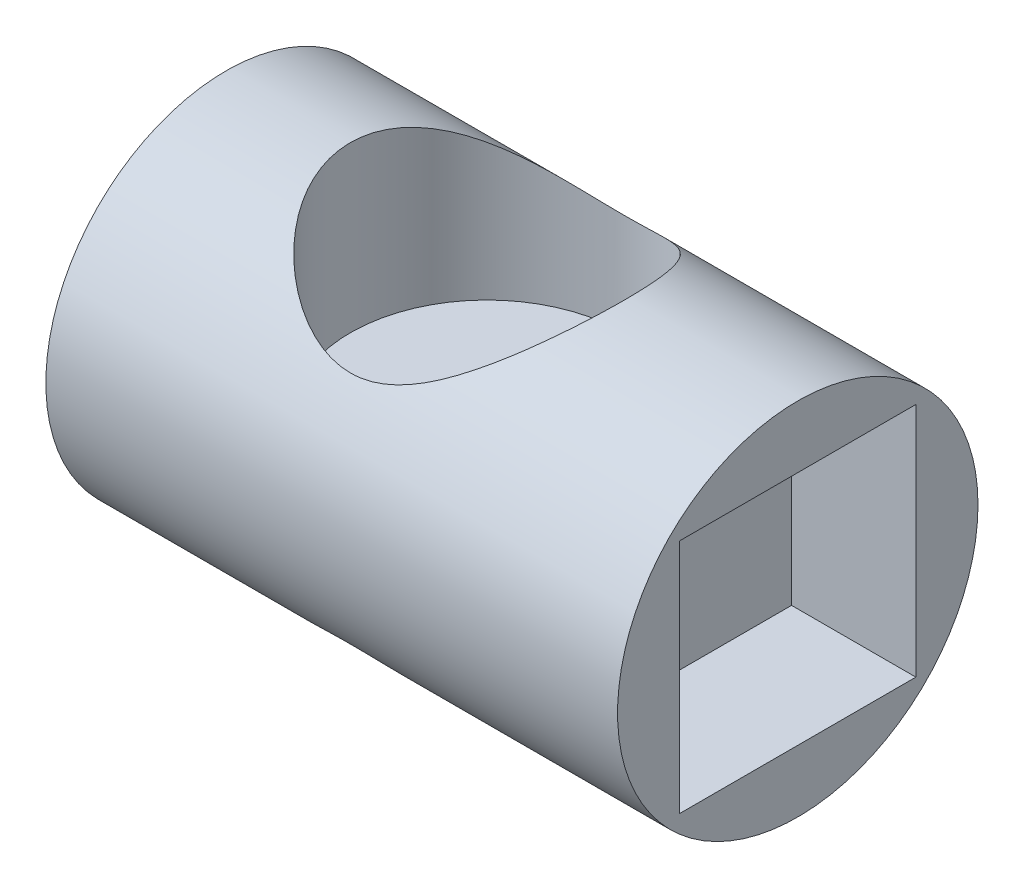
ISO-10303-21;
HEADER;
FILE_DESCRIPTION(('STEP AP214'),'2;1');
FILE_NAME('part.step','',(''),(''),'','','');
FILE_SCHEMA(('AUTOMOTIVE_DESIGN { 1 0 10303 214 1 1 1 1 }'));
ENDSEC;
DATA;
#1=APPLICATION_CONTEXT('core data for automotive mechanical design processes');
#2=APPLICATION_PROTOCOL_DEFINITION('international standard','automotive_design',2000,#1);
#3=PRODUCT_CONTEXT('',#1,'mechanical');
#4=PRODUCT('Part','Part','',(#3));
#5=PRODUCT_RELATED_PRODUCT_CATEGORY('part','',(#4));
#6=PRODUCT_DEFINITION_FORMATION('','',#4);
#7=PRODUCT_DEFINITION_CONTEXT('part definition',#1,'design');
#8=PRODUCT_DEFINITION('design','',#6,#7);
#9=PRODUCT_DEFINITION_SHAPE('','',#8);
#10=(LENGTH_UNIT() NAMED_UNIT(*) SI_UNIT(.MILLI.,.METRE.));
#11=(NAMED_UNIT(*) PLANE_ANGLE_UNIT() SI_UNIT($,.RADIAN.));
#12=(NAMED_UNIT(*) SI_UNIT($,.STERADIAN.) SOLID_ANGLE_UNIT());
#13=UNCERTAINTY_MEASURE_WITH_UNIT(LENGTH_MEASURE(1.E-05),#10,'distance_accuracy_value','');
#14=(GEOMETRIC_REPRESENTATION_CONTEXT(3) GLOBAL_UNCERTAINTY_ASSIGNED_CONTEXT((#13)) GLOBAL_UNIT_ASSIGNED_CONTEXT((#10,
#11,#12)) REPRESENTATION_CONTEXT('',''));
#15=CARTESIAN_POINT('',(0.,0.,0.));
#16=DIRECTION('',(0.,0.,1.));
#17=DIRECTION('',(1.,0.,0.));
#18=AXIS2_PLACEMENT_3D('',#15,#16,#17);
#19=CARTESIAN_POINT('',(21.,-14.5,0.));
#20=DIRECTION('',(0.,1.,0.));
#21=DIRECTION('',(0.,0.,1.));
#22=AXIS2_PLACEMENT_3D('',#19,#20,#21);
#23=CYLINDRICAL_SURFACE('',#22,11.);
#24=CARTESIAN_POINT('',(21.,9.4472218138456,11.));
#25=CARTESIAN_POINT('',(20.7446005731994,9.44721013003408,11.0000053962607));
#26=CARTESIAN_POINT('',(20.4892475808609,9.45763074036552,10.9910847628613));
#27=CARTESIAN_POINT('',(19.9812966515893,9.49861453554439,10.9556864130435));
#28=CARTESIAN_POINT('',(19.7286999122017,9.52918614709357,10.9292013515423));
#29=CARTESIAN_POINT('',(19.2281162230338,9.60875959209538,10.8593055433644));
#30=CARTESIAN_POINT('',(18.980144536923,9.65781392671205,10.8158465683821));
#31=CARTESIAN_POINT('',(18.4912154456175,9.77176611045917,10.713004298025));
#32=CARTESIAN_POINT('',(18.2502608810947,9.83667027881275,10.6536146502652));
#33=CARTESIAN_POINT('',(17.7278508311446,9.99413843126568,10.5062393116843));
#34=CARTESIAN_POINT('',(17.4482376542905,10.0896454125048,10.4148859145522));
#35=CARTESIAN_POINT('',(16.9017309924322,10.2947353646413,10.2122084113692));
#36=CARTESIAN_POINT('',(16.634841312876,10.4043225109854,10.1008783773846));
#37=CARTESIAN_POINT('',(16.1138628099463,10.633416801049,9.85942033437389));
#38=CARTESIAN_POINT('',(15.8597860185945,10.752932999861,9.72927508440315));
#39=CARTESIAN_POINT('',(15.3647821219516,10.9981573583915,9.4511855004057));
#40=CARTESIAN_POINT('',(15.1238538623957,11.1238649727376,9.30324273242778));
#41=CARTESIAN_POINT('',(14.6496884405595,11.3813843435625,8.98647503272673));
#42=CARTESIAN_POINT('',(14.4167650943934,11.513270125585,8.81724105492348));
#43=CARTESIAN_POINT('',(13.9650003772183,11.777421398586,8.46117578026142));
#44=CARTESIAN_POINT('',(13.7461594601614,11.9096869016616,8.27434391660652));
#45=CARTESIAN_POINT('',(13.323243272907,12.1718980708835,7.88354162957728));
#46=CARTESIAN_POINT('',(13.1191562286228,12.3018455231071,7.67958515957763));
#47=CARTESIAN_POINT('',(12.7263445491918,12.5571135283023,7.25467594975962));
#48=CARTESIAN_POINT('',(12.5376191921205,12.6824342985539,7.0337240095958));
#49=CARTESIAN_POINT('',(12.1841487686781,12.9210277801072,6.58475047418892));
#50=CARTESIAN_POINT('',(12.0187309549608,13.0345851577173,6.35741081944071));
#51=CARTESIAN_POINT('',(11.7041789357794,13.2532832012861,5.88791388609163));
#52=CARTESIAN_POINT('',(11.5550423286284,13.3584251080226,5.64575880120278));
#53=CARTESIAN_POINT('',(11.2744005833059,13.5583031305105,5.14728251864729));
#54=CARTESIAN_POINT('',(11.1428964591558,13.6530386477472,4.890960507455));
#55=CARTESIAN_POINT('',(10.899061672083,13.8301095568366,4.36520310201093));
#56=CARTESIAN_POINT('',(10.7867308571487,13.9124450469996,4.09576781174676));
#57=CARTESIAN_POINT('',(10.5818864605032,14.0635080367425,3.54269117523006));
#58=CARTESIAN_POINT('',(10.489566637256,14.1321020386283,3.25894112415066));
#59=CARTESIAN_POINT('',(10.3276560879849,14.2529301627279,2.68159310498928));
#60=CARTESIAN_POINT('',(10.2580656977573,14.3051640432426,2.3879949914863));
#61=CARTESIAN_POINT('',(10.1430350190557,14.3917425887695,1.79381680118851));
#62=CARTESIAN_POINT('',(10.0975694976625,14.4261059443434,1.49324436396518));
#63=CARTESIAN_POINT('',(10.0316634311159,14.4759779301114,0.887836847006029));
#64=CARTESIAN_POINT('',(10.011218350977,14.4914899771246,0.583002549871173));
#65=CARTESIAN_POINT('',(9.99697456015311,14.5022951122689,0.0191532514537094));
#66=CARTESIAN_POINT('',(9.9995740556368,14.5003212340597,-0.239728083308296));
#67=CARTESIAN_POINT('',(10.0229786577541,14.4825735357256,-0.756168884056039));
#68=CARTESIAN_POINT('',(10.0437815491972,14.466801394726,-1.01372850704638));
#69=CARTESIAN_POINT('',(10.1032566176035,14.4218112561184,-1.5255743748675));
#70=CARTESIAN_POINT('',(10.1419288367452,14.3925932267727,-1.77986061197035));
#71=CARTESIAN_POINT('',(10.2365496923116,14.3213439940016,-2.28336585007412));
#72=CARTESIAN_POINT('',(10.2924987949328,14.2793124448187,-2.53258471414444));
#73=CARTESIAN_POINT('',(10.4188662112244,14.1848049306593,-3.01665691232354));
#74=CARTESIAN_POINT('',(10.4887764689209,14.1326973134494,-3.25171570565768));
#75=CARTESIAN_POINT('',(10.6432508419367,14.0181869382912,-3.71446803121913));
#76=CARTESIAN_POINT('',(10.7278199975143,13.9557806396395,-3.9421589980619));
#77=CARTESIAN_POINT('',(10.9106759363655,13.821743508934,-4.38905653032595));
#78=CARTESIAN_POINT('',(11.0089586558296,13.750115410107,-4.60826558474397));
#79=CARTESIAN_POINT('',(11.2184009719652,13.598692741047,-5.03759843696701));
#80=CARTESIAN_POINT('',(11.329565180314,13.518895247303,-5.24771894379783));
#81=CARTESIAN_POINT('',(11.57931069303,13.3413151256279,-5.68525622271182));
#82=CARTESIAN_POINT('',(11.7195750094641,13.2425474243487,-5.91131281440471));
#83=CARTESIAN_POINT('',(12.0143942824856,13.0376328989273,-6.35050280147834));
#84=CARTESIAN_POINT('',(12.168955314729,12.9314829423574,-6.56363063824565));
#85=CARTESIAN_POINT('',(12.4915120811749,12.7133877120263,-6.97670204480597));
#86=CARTESIAN_POINT('',(12.65952101416,12.6014367837054,-7.17663230155408));
#87=CARTESIAN_POINT('',(13.007989357298,12.3735550574495,-7.5627632943957));
#88=CARTESIAN_POINT('',(13.1884455365494,12.2576252961865,-7.74896756754339));
#89=CARTESIAN_POINT('',(13.5992781137841,11.999589347544,-8.14409487666419));
#90=CARTESIAN_POINT('',(13.8323301956264,11.8569660770201,-8.34990756101367));
#91=CARTESIAN_POINT('',(14.3149849918195,11.5715822457024,-8.74111708661796));
#92=CARTESIAN_POINT('',(14.5645916885937,11.4288216600751,-8.92650898664418));
#93=CARTESIAN_POINT('',(15.0799793125307,11.1467542073603,-9.27633074393075));
#94=CARTESIAN_POINT('',(15.3457595967932,11.0074472033024,-9.44076143359641));
#95=CARTESIAN_POINT('',(15.893164846849,10.7365346578383,-9.7477573424368));
#96=CARTESIAN_POINT('',(16.1747840035178,10.6049263285031,-9.89033050759571));
#97=CARTESIAN_POINT('',(16.8820225680502,10.2988403929331,-10.2103852814441));
#98=CARTESIAN_POINT('',(17.3164177685242,10.1310238103847,-10.3755696610211));
#99=CARTESIAN_POINT('',(17.990513158732,9.91271888245807,-10.5829190929381));
#100=CARTESIAN_POINT('',(18.2187933546612,9.8455561351279,-10.6452679947208));
#101=CARTESIAN_POINT('',(18.6823508799743,9.72478699167608,-10.755705579152));
#102=CARTESIAN_POINT('',(18.9176268416272,9.67117796491229,-10.8037970293431));
#103=CARTESIAN_POINT('',(19.3565044920963,9.58708676432307,-10.878438295101));
#104=CARTESIAN_POINT('',(19.5592925002817,9.55429699687812,-10.9071827835972));
#105=CARTESIAN_POINT('',(19.9677847372214,9.50128871945125,-10.9533902421926));
#106=CARTESIAN_POINT('',(20.1734886271991,9.48106876111564,-10.9708545120617));
#107=CARTESIAN_POINT('',(20.5863030136865,9.45403400454883,-10.9941604719313));
#108=CARTESIAN_POINT('',(20.7934124864499,9.44721032165024,-11.0000098651708));
#109=CARTESIAN_POINT('',(21.2076359925952,9.44723333611966,-10.9999901098441));
#110=CARTESIAN_POINT('',(21.4147500259618,9.45408037456052,-10.994120668903));
#111=CARTESIAN_POINT('',(21.8270282419879,9.48112527918065,-10.9708056199273));
#112=CARTESIAN_POINT('',(22.0321954419972,9.50129705366565,-10.9533826350876));
#113=CARTESIAN_POINT('',(22.4396156684479,9.55414443109361,-10.9073161148268));
#114=CARTESIAN_POINT('',(22.6418686910523,9.58682005049894,-10.8786725646328));
#115=CARTESIAN_POINT('',(23.0426274607199,9.66351791491279,-10.8105987047357));
#116=CARTESIAN_POINT('',(23.2411279143869,9.70755506629482,-10.7711542199623));
#117=CARTESIAN_POINT('',(23.6333502616936,9.80553124731211,-10.6820381420964));
#118=CARTESIAN_POINT('',(23.8270708000647,9.85947304947362,-10.6323636849386));
#119=CARTESIAN_POINT('',(24.299360163012,10.0031998867287,-10.497606160448));
#120=CARTESIAN_POINT('',(24.574838779855,10.0978885154694,-10.406874650618));
#121=CARTESIAN_POINT('',(25.1134392405173,10.3008766147287,-10.2059946585574));
#122=CARTESIAN_POINT('',(25.3765551351922,10.4091825478077,-10.095836946894));
#123=CARTESIAN_POINT('',(25.8905533679061,10.635515118399,-9.85712524475205));
#124=CARTESIAN_POINT('',(26.141413085466,10.7535587234703,-9.72853884275836));
#125=CARTESIAN_POINT('',(26.6302974787169,10.9956883553227,-9.45401186157303));
#126=CARTESIAN_POINT('',(26.8683237664215,11.119773619464,-9.30807346938985));
#127=CARTESIAN_POINT('',(27.3403267456663,11.3758057867641,-8.99353751848172));
#128=CARTESIAN_POINT('',(27.5738043986639,11.50787215031,-8.82428889316765));
#129=CARTESIAN_POINT('',(28.0266432606438,11.7724237356509,-8.46813209022814));
#130=CARTESIAN_POINT('',(28.2460037092306,11.9049089796055,-8.28122296269046));
#131=CARTESIAN_POINT('',(28.6699049766904,12.1675718207479,-7.89022311210566));
#132=CARTESIAN_POINT('',(28.8744586693031,12.2977513464043,-7.68614765644159));
#133=CARTESIAN_POINT('',(29.268165904698,12.5534926493628,-7.26094811044577));
#134=CARTESIAN_POINT('',(29.4573202701875,12.6790546731577,-7.03982493211712));
#135=CARTESIAN_POINT('',(29.8114148130292,12.9179994094048,-6.59069031310145));
#136=CARTESIAN_POINT('',(29.9770448539607,13.0316733862846,-6.36337874222172));
#137=CARTESIAN_POINT('',(30.2920173924355,13.2506140971324,-5.89391968129911));
#138=CARTESIAN_POINT('',(30.4413622969603,13.3558820729096,-5.65177439199993));
#139=CARTESIAN_POINT('',(30.7224150743331,13.5560179568196,-5.15330019708582));
#140=CARTESIAN_POINT('',(30.8541220942565,13.6508853619662,-4.89697060639957));
#141=CARTESIAN_POINT('',(31.0983575031073,13.8282238318034,-4.37117688472371));
#142=CARTESIAN_POINT('',(31.2108860477044,13.9106949971122,-4.10171286036782));
#143=CARTESIAN_POINT('',(31.4161219126301,14.0620320231684,-3.54855182212747));
#144=CARTESIAN_POINT('',(31.5086351134317,14.1307641874227,-3.26474572653722));
#145=CARTESIAN_POINT('',(31.6709213602876,14.2518645214098,-2.6872612943053));
#146=CARTESIAN_POINT('',(31.7406940679746,14.3042324476504,-2.39358281083916));
#147=CARTESIAN_POINT('',(31.8560745551931,14.3910705645815,-1.79921877655629));
#148=CARTESIAN_POINT('',(31.9017074829928,14.4255593805649,-1.49854085998119));
#149=CARTESIAN_POINT('',(31.9679292003432,14.4756691169148,-0.892900411694154));
#150=CARTESIAN_POINT('',(31.9885225417951,14.4912934666151,-0.587938668930658));
#151=CARTESIAN_POINT('',(32.0030173886445,14.502288982725,-0.0239030182582929));
#152=CARTESIAN_POINT('',(32.0005285729192,14.5003991283895,0.23503445536811));
#153=CARTESIAN_POINT('',(31.9773365278626,14.4828124671002,0.75159902123452));
#154=CARTESIAN_POINT('',(31.9566355180198,14.4671173425706,1.00922626930166));
#155=CARTESIAN_POINT('',(31.8973540078825,14.4222727203285,1.52121673751947));
#156=CARTESIAN_POINT('',(31.8587734814424,14.3931232029413,1.77557995289649));
#157=CARTESIAN_POINT('',(31.7643248766409,14.322001428574,2.27924647951347));
#158=CARTESIAN_POINT('',(31.7084563341778,14.2800288273552,2.52854965472376));
#159=CARTESIAN_POINT('',(31.5822542764109,14.1856409581513,3.01272324915728));
#160=CARTESIAN_POINT('',(31.5124336806171,14.13359761845,3.24780079647553));
#161=CARTESIAN_POINT('',(31.3581361896018,14.0192119519604,3.71059796351291));
#162=CARTESIAN_POINT('',(31.2736542539054,13.9568660835822,3.93831502069889));
#163=CARTESIAN_POINT('',(31.0909707205792,13.8229458369122,4.38526892288721));
#164=CARTESIAN_POINT('',(30.9927733134741,13.7513742778835,4.60450833206177));
#165=CARTESIAN_POINT('',(30.7834989314865,13.6000597596011,5.03390731093091));
#166=CARTESIAN_POINT('',(30.6724173448641,13.5203138756389,5.24406359225238));
#167=CARTESIAN_POINT('',(30.4228667768387,13.3428534184002,5.68164407185484));
#168=CARTESIAN_POINT('',(30.2827169259889,13.2441544893266,5.90771074977674));
#169=CARTESIAN_POINT('',(29.9881280644382,13.0393722272451,6.34693014096491));
#170=CARTESIAN_POINT('',(29.8336829739371,12.9332857570922,6.5600772951585));
#171=CARTESIAN_POINT('',(29.5113552804548,12.7153078104357,6.973201984942));
#172=CARTESIAN_POINT('',(29.3434590867524,12.603410503973,7.17316581895707));
#173=CARTESIAN_POINT('',(28.9952174378422,12.3756277195907,7.55937128182098));
#174=CARTESIAN_POINT('',(28.8148752337077,12.259743287101,7.7456164680926));
#175=CARTESIAN_POINT('',(28.4042975105939,12.0017968547931,8.14084215217107));
#176=CARTESIAN_POINT('',(28.1713871611938,11.8592157492498,8.34671373156696));
#177=CARTESIAN_POINT('',(27.6890098087629,11.5738933949275,8.73805714335605));
#178=CARTESIAN_POINT('',(27.4395387287275,11.4311521152825,8.92352392230609));
#179=CARTESIAN_POINT('',(26.924476033002,11.1491238137626,9.27348514430885));
#180=CARTESIAN_POINT('',(26.6588859095727,11.0098364738071,9.43798152439053));
#181=CARTESIAN_POINT('',(26.1117479498648,10.7388773676928,9.74517375047272));
#182=CARTESIAN_POINT('',(25.830206343644,10.6072026683652,9.88787802828134));
#183=CARTESIAN_POINT('',(25.3353150022955,10.3928211143522,10.1121656257553));
#184=CARTESIAN_POINT('',(25.1258952750025,10.3069954998337,10.1994662129412));
#185=CARTESIAN_POINT('',(24.6991654203747,10.1437153652997,10.3618670394071));
#186=CARTESIAN_POINT('',(24.4818554816369,10.0662606453735,10.436967570066));
#187=CARTESIAN_POINT('',(24.0402030164851,9.92216717258131,10.5740474778804));
#188=CARTESIAN_POINT('',(23.815878097567,9.85550358467893,10.6360570859731));
#189=CARTESIAN_POINT('',(23.3605188190806,9.73518514887123,10.7462934620317));
#190=CARTESIAN_POINT('',(23.1294868341945,9.68152575815303,10.7945250441909));
#191=CARTESIAN_POINT('',(22.5865721916089,9.57474040810346,10.8894933730591));
#192=CARTESIAN_POINT('',(22.2725516964588,9.52731970195756,10.9307758964792));
#193=CARTESIAN_POINT('',(21.6389952689957,9.46357316110076,10.9860210475069));
#194=CARTESIAN_POINT('',(21.3194613093724,9.44723642830959,10.9999932501943));
#195=CARTESIAN_POINT('',(21.,9.4472218138456,11.));
#196=B_SPLINE_CURVE_WITH_KNOTS('',3,(#24,#25,#26,#27,#28,#29,#30,#31,#32,#33,#34,#35,#36,#37,
#38,#39,#40,#41,#42,#43,#44,#45,#46,#47,#48,#49,#50,#51,#52,#53,#54,#55,#56,#57,#58,#59,#60,#61,
#62,#63,#64,#65,#66,#67,#68,#69,#70,#71,#72,#73,#74,#75,#76,#77,#78,#79,#80,#81,#82,#83,#84,#85,
#86,#87,#88,#89,#90,#91,#92,#93,#94,#95,#96,#97,#98,#99,#100,#101,#102,#103,#104,#105,#106,#107,
#108,#109,#110,#111,#112,#113,#114,#115,#116,#117,#118,#119,#120,#121,#122,#123,#124,#125,#126,
#127,#128,#129,#130,#131,#132,#133,#134,#135,#136,#137,#138,#139,#140,#141,#142,#143,#144,#145,
#146,#147,#148,#149,#150,#151,#152,#153,#154,#155,#156,#157,#158,#159,#160,#161,#162,#163,#164,
#165,#166,#167,#168,#169,#170,#171,#172,#173,#174,#175,#176,#177,#178,#179,#180,#181,#182,#183,
#184,#185,#186,#187,#188,#189,#190,#191,#192,#193,#194,#195),.UNSPECIFIED.,.T.,.F.,(4,2,2,2,2,2,
2,2,2,2,2,2,2,2,2,2,2,2,2,2,2,2,2,2,2,2,2,2,2,2,2,2,2,2,2,2,2,2,2,2,2,2,2,2,2,2,2,2,2,2,2,2,2,2,
2,2,2,2,2,2,2,2,2,2,2,2,2,2,2,2,2,2,2,2,2,2,2,2,2,2,2,2,2,2,2,4),(0.,0.765761197113641,
1.53184282190678,2.30011715201973,3.0686982895126,3.99508719102788,4.92175144825538,
5.84927028188841,6.7767075603991,7.72594072197314,8.67520446709229,9.62370210831125,
10.5721551489957,11.4809490090468,12.3896086286749,13.2983204817567,14.2070251299753,
15.1241700578677,16.0413285347096,16.9575258277821,17.8735570343724,18.6492782828678,
19.4249051461543,20.2005338402339,20.9761834655795,21.7275398552692,22.4791551027318,
23.2305480914279,23.982210920868,24.832740828849,25.6836338607004,26.5353725117448,
27.3868909050337,28.41205350849,29.4374636287013,30.4628330154399,31.487828755639,
32.9644420769623,33.7017108312088,34.4388363788913,35.0604567397485,35.6820054612446,
36.303141820234,36.9242936762407,37.5442328214504,38.1641727828659,38.7849302811432,
39.4058618085234,40.3197511091319,41.2340757761695,42.1500287111336,43.065866323443,
44.016565453485,44.9673157482876,45.9172292288164,46.8670919269788,47.7763008734411,
48.6853752540115,49.5944935793099,50.503604525034,51.4211722579986,52.3387536432893,
53.2553772214152,54.1718341432659,54.9477180581571,55.7235074305247,56.4992979373525,
57.2751092722979,58.0264033189478,58.7779561692143,59.529279895793,60.2808733845938,
61.1311861470359,61.9818622260077,62.8334089211421,63.684734016104,64.7096677435307,
65.7348547368543,66.7599469652666,67.7846415541544,68.5118732695426,69.2390876135994,
69.9646037692915,70.6898661107408,71.6480393205747,72.6058765317265),.UNSPECIFIED.);
#197=CARTESIAN_POINT('',(21.,9.4472218138456,11.));
#198=VERTEX_POINT('',#197);
#199=EDGE_CURVE('E122',#198,#198,#196,.T.);
#200=ORIENTED_EDGE('',*,*,#199,.F.);
#201=EDGE_LOOP('',(#200));
#202=FACE_BOUND('',#201,.T.);
#203=CARTESIAN_POINT('',(21.,1.25,0.));
#204=DIRECTION('',(0.,1.,0.));
#205=DIRECTION('',(0.,0.,1.));
#206=AXIS2_PLACEMENT_3D('',#203,#204,#205);
#207=CIRCLE('',#206,11.);
#208=CARTESIAN_POINT('',(21.,1.25,11.));
#209=VERTEX_POINT('',#208);
#210=EDGE_CURVE('E11',#209,#209,#207,.F.);
#211=ORIENTED_EDGE('',*,*,#210,.T.);
#212=EDGE_LOOP('',(#211));
#213=FACE_BOUND('',#212,.T.);
#214=ADVANCED_FACE('F33',(#202,#213),#23,.F.);
#215=CARTESIAN_POINT('',(46.,0.,0.));
#216=DIRECTION('',(-1.,0.,0.));
#217=DIRECTION('',(0.,0.,1.));
#218=AXIS2_PLACEMENT_3D('',#215,#216,#217);
#219=CYLINDRICAL_SURFACE('',#218,14.5);
#220=CARTESIAN_POINT('',(10.,-14.5,0.));
#221=CARTESIAN_POINT('',(10.0000016714376,-14.4999983813995,0.267931236370922));
#222=CARTESIAN_POINT('',(10.0098053406393,-14.4925571571038,0.535891284850527));
#223=CARTESIAN_POINT('',(10.0488606491849,-14.4629628373543,1.06968085359228));
#224=CARTESIAN_POINT('',(10.0781218342253,-14.4408025208415,1.33550926327503));
#225=CARTESIAN_POINT('',(10.1556712826876,-14.3822396863299,1.86327771978829));
#226=CARTESIAN_POINT('',(10.2039943444698,-14.3458111218325,2.12520974094467));
#227=CARTESIAN_POINT('',(10.31888533128,-14.2595502186923,2.64273557922553));
#228=CARTESIAN_POINT('',(10.3854513016241,-14.2097193160883,2.8983300722032));
#229=CARTESIAN_POINT('',(10.535406519254,-14.0980576171213,3.40006395971807));
#230=CARTESIAN_POINT('',(10.6186918979768,-14.0363009947338,3.64625107622849));
#231=CARTESIAN_POINT('',(10.8012754590606,-13.9018045885992,4.12949688877323));
#232=CARTESIAN_POINT('',(10.9005740243142,-13.8290645422292,4.36655536636386));
#233=CARTESIAN_POINT('',(11.1140399152212,-13.6739472205585,4.83041935493877));
#234=CARTESIAN_POINT('',(11.2281994855291,-13.5915749741708,5.057230131186));
#235=CARTESIAN_POINT('',(11.4704188903447,-13.4184848665506,5.50007385307441));
#236=CARTESIAN_POINT('',(11.5984839007753,-13.3277638996622,5.71610274147618));
#237=CARTESIAN_POINT('',(11.8800147135795,-13.1306172422698,6.15632434312548));
#238=CARTESIAN_POINT('',(12.0347349775733,-13.0235155289152,6.37941142381062));
#239=CARTESIAN_POINT('',(12.3584704615375,-12.8028124080891,6.81152430082023));
#240=CARTESIAN_POINT('',(12.5274860455746,-12.689210835106,7.02054973878558));
#241=CARTESIAN_POINT('',(12.8791374977055,-12.4571634989094,7.42451370650809));
#242=CARTESIAN_POINT('',(13.0617915309414,-12.3387113735096,7.61943274249101));
#243=CARTESIAN_POINT('',(13.4398156704488,-12.098968126395,7.99465771014497));
#244=CARTESIAN_POINT('',(13.6351870842416,-11.977676713586,8.17496213494129));
#245=CARTESIAN_POINT('',(14.0800352313357,-11.708896293238,8.55668983061748));
#246=CARTESIAN_POINT('',(14.3323173600541,-11.5612021311064,8.75471314408127));
#247=CARTESIAN_POINT('',(14.8542255323942,-11.2682674869752,9.12866788374886));
#248=CARTESIAN_POINT('',(15.123856863778,-11.1230277702448,9.30459252593426));
#249=CARTESIAN_POINT('',(15.6800025310963,-10.8395213611502,9.63337029329806));
#250=CARTESIAN_POINT('',(15.9665009492639,-10.7012483159039,9.78624470107052));
#251=CARTESIAN_POINT('',(16.5562440374423,-10.4368301853407,10.0677633908297));
#252=CARTESIAN_POINT('',(16.8594790033424,-10.3106781859774,10.1964215268321));
#253=CARTESIAN_POINT('',(17.5770028749383,-10.0412117255351,10.4627905821154));
#254=CARTESIAN_POINT('',(17.9972090569238,-9.90419089479268,10.5915348896066));
#255=CARTESIAN_POINT('',(18.6451719634091,-9.734053122295,10.7472852626036));
#256=CARTESIAN_POINT('',(18.8639688730122,-9.68325880814531,10.7929585752312));
#257=CARTESIAN_POINT('',(19.3065579289575,-9.59535278451306,10.8711854212399));
#258=CARTESIAN_POINT('',(19.5303474005424,-9.55823392665764,10.9037458097806));
#259=CARTESIAN_POINT('',(19.9838214035717,-9.49903114363536,10.955363242765));
#260=CARTESIAN_POINT('',(20.2135427659979,-9.4771042520607,10.9742793310965));
#261=CARTESIAN_POINT('',(20.6747168613575,-9.45001826379199,10.9976125616165));
#262=CARTESIAN_POINT('',(20.9061695344138,-9.44485858987002,11.0020302029283));
#263=CARTESIAN_POINT('',(21.3686918878708,-9.45158416518381,10.9962527119655));
#264=CARTESIAN_POINT('',(21.5997614666234,-9.46347338079721,10.9860541792782));
#265=CARTESIAN_POINT('',(22.0593578312109,-9.5036739248699,10.9512957781842));
#266=CARTESIAN_POINT('',(22.2878845997453,-9.53198536499256,10.9267358121266));
#267=CARTESIAN_POINT('',(22.7144690794465,-9.59949325253172,10.8674506279756));
#268=CARTESIAN_POINT('',(22.9130000798801,-9.63705692350059,10.8342252023066));
#269=CARTESIAN_POINT('',(23.3057969049971,-9.72264989218975,10.7574804279601));
#270=CARTESIAN_POINT('',(23.5000611869305,-9.77068290898493,10.7139574207532));
#271=CARTESIAN_POINT('',(24.0755960060499,-9.92840220574848,10.5686908005224));
#272=CARTESIAN_POINT('',(24.4495522384144,-10.051699120652,10.4522576400442));
#273=CARTESIAN_POINT('',(25.1094481160853,-10.2986063479245,10.2084839958866));
#274=CARTESIAN_POINT('',(25.39912583227,-10.4181762485554,10.086866477025));
#275=CARTESIAN_POINT('',(25.9632695060718,-10.6686548681213,9.82156272980583));
#276=CARTESIAN_POINT('',(26.2377272738248,-10.7995695964631,9.6778647737966));
#277=CARTESIAN_POINT('',(26.7716833370376,-11.068377762393,9.3692578058161));
#278=CARTESIAN_POINT('',(27.0311488715045,-11.2062853320815,9.2043047107557));
#279=CARTESIAN_POINT('',(27.5343406348127,-11.4849360219501,8.85416901980978));
#280=CARTESIAN_POINT('',(27.7780694014997,-11.6256786800922,8.66898969880907));
#281=CARTESIAN_POINT('',(28.2561510614184,-11.9106616376195,8.27328675876451));
#282=CARTESIAN_POINT('',(28.4900403735736,-12.0548876122457,8.06219225768275));
#283=CARTESIAN_POINT('',(28.9400465206631,-12.3395294041809,7.61940263679445));
#284=CARTESIAN_POINT('',(29.1561615522798,-12.4799448339191,7.38770543165894));
#285=CARTESIAN_POINT('',(29.5690507756634,-12.7536186739253,6.90450478509945));
#286=CARTESIAN_POINT('',(29.7658562930081,-12.8868885115568,6.65303465648948));
#287=CARTESIAN_POINT('',(30.1388998034856,-13.1434839573531,6.13053718987999));
#288=CARTESIAN_POINT('',(30.315142769151,-13.2668119674584,5.85951460590942));
#289=CARTESIAN_POINT('',(30.6132459961489,-13.4779704504229,5.35298023029199));
#290=CARTESIAN_POINT('',(30.7390362162028,-13.568057190239,5.12071538285118));
#291=CARTESIAN_POINT('',(30.9747863373416,-13.7382570918818,4.64479537381313));
#292=CARTESIAN_POINT('',(31.0847494748573,-13.8183722923032,4.40114255444489));
#293=CARTESIAN_POINT('',(31.2876006747981,-13.9671032412041,3.90351574050186));
#294=CARTESIAN_POINT('',(31.3804945892226,-14.0357229300808,3.64954531980605));
#295=CARTESIAN_POINT('',(31.5480297650433,-14.1600769636466,3.13255379129657));
#296=CARTESIAN_POINT('',(31.6226708211337,-14.215811163401,2.86953258171879));
#297=CARTESIAN_POINT('',(31.7530005852141,-14.3134602602467,2.33437701820654));
#298=CARTESIAN_POINT('',(31.8085594180687,-14.3552803991702,2.06219354116556));
#299=CARTESIAN_POINT('',(31.8990784743397,-14.4235580566811,1.51250324767144));
#300=CARTESIAN_POINT('',(31.9340386325194,-14.4500155266145,1.23499641436194));
#301=CARTESIAN_POINT('',(31.9827040884464,-14.4868746229138,0.677172132959887));
#302=CARTESIAN_POINT('',(31.996417992874,-14.4972827507263,0.39685586928444));
#303=CARTESIAN_POINT('',(32.0023509437703,-14.5017833502408,-0.164121524649094));
#304=CARTESIAN_POINT('',(31.9945719056969,-14.4958772758698,-0.444782621947302));
#305=CARTESIAN_POINT('',(31.9596668110849,-14.4694225517883,-0.973774057478503));
#306=CARTESIAN_POINT('',(31.9347118295374,-14.4505172711548,-1.22233473031081));
#307=CARTESIAN_POINT('',(31.8681924883111,-14.4002476527332,-1.71592381995816));
#308=CARTESIAN_POINT('',(31.8266295432128,-14.368884376054,-1.96095253576591));
#309=CARTESIAN_POINT('',(31.7274748231108,-14.2943222665919,-2.44592674278206));
#310=CARTESIAN_POINT('',(31.6698811100755,-14.2511220027923,-2.68587161560514));
#311=CARTESIAN_POINT('',(31.5394156920845,-14.1537062987893,-3.15927416180196));
#312=CARTESIAN_POINT('',(31.4665432518907,-14.0994903284956,-3.3927315223732));
#313=CARTESIAN_POINT('',(31.3041886938051,-13.9793861305469,-3.85825032640517));
#314=CARTESIAN_POINT('',(31.214308976648,-13.9132207149003,-4.09010138068012));
#315=CARTESIAN_POINT('',(31.0202786510873,-13.7714056411596,-4.54479662520881));
#316=CARTESIAN_POINT('',(30.9161229574387,-13.6957526043005,-4.76763756917684));
#317=CARTESIAN_POINT('',(30.5837777234549,-13.4564133051891,-5.4212469765565));
#318=CARTESIAN_POINT('',(30.3355858665542,-13.2802536309057,-5.83745244634797));
#319=CARTESIAN_POINT('',(29.7482715166824,-12.8736133984186,-6.69173088448535));
#320=CARTESIAN_POINT('',(29.4009057327115,-12.6389645086384,-7.12212179767556));
#321=CARTESIAN_POINT('',(28.8387859739429,-12.2750269481687,-7.72196744841365));
#322=CARTESIAN_POINT('',(28.6442718584875,-12.1515424290462,-7.91452556008708));
#323=CARTESIAN_POINT('',(28.2421415508362,-11.9026735052256,-8.28407610243155));
#324=CARTESIAN_POINT('',(28.0345283572738,-11.7772895403058,-8.46107207353264));
#325=CARTESIAN_POINT('',(27.5641842075354,-11.501966881179,-8.83279845328198));
#326=CARTESIAN_POINT('',(27.2986878511876,-11.3520899076328,-9.0240846415953));
#327=CARTESIAN_POINT('',(26.7497665350122,-11.0569540952872,-9.38337979324622));
#328=CARTESIAN_POINT('',(26.4663351779317,-10.9116969324095,-9.55138038187271));
#329=CARTESIAN_POINT('',(25.8822940229831,-10.6311470355588,-9.86268343705584));
#330=CARTESIAN_POINT('',(25.5817179951189,-10.4958358379889,-10.0060323655904));
#331=CARTESIAN_POINT('',(24.9631794926901,-10.2409737743148,-10.266725886499));
#332=CARTESIAN_POINT('',(24.6452305274298,-10.1214109021883,-10.3840903356412));
#333=CARTESIAN_POINT('',(24.1183500404287,-9.9467722294718,-10.5508395812174));
#334=CARTESIAN_POINT('',(23.914524713704,-9.8845809523548,-10.6090084458271));
#335=CARTESIAN_POINT('',(23.5011305412315,-9.77068098505939,-10.7139997420193));
#336=CARTESIAN_POINT('',(23.2915637262536,-9.71896864145142,-10.760826129218));
#337=CARTESIAN_POINT('',(22.8678707536291,-9.62788885359677,-10.8423936545314));
#338=CARTESIAN_POINT('',(22.6537544220091,-9.58849722113291,-10.8771584869389));
#339=CARTESIAN_POINT('',(22.2217563443905,-9.52350325453026,-10.9341101105713));
#340=CARTESIAN_POINT('',(22.0038746150303,-9.49790085947654,-10.9562969573602));
#341=CARTESIAN_POINT('',(21.564394548033,-9.46151543298158,-10.9877348968925));
#342=CARTESIAN_POINT('',(21.3427808992492,-9.45083674223395,-10.9968949189369));
#343=CARTESIAN_POINT('',(20.8992096047744,-9.44515646989019,-11.0017741452596));
#344=CARTESIAN_POINT('',(20.677251970484,-9.4501543793887,-10.9974937858495));
#345=CARTESIAN_POINT('',(20.2346979971965,-9.4755913870667,-10.9755839952263));
#346=CARTESIAN_POINT('',(20.0141030624763,-9.49604437235531,-10.957942558427));
#347=CARTESIAN_POINT('',(19.5761840645702,-9.55144144966649,-10.9096884032641));
#348=CARTESIAN_POINT('',(19.3588604413376,-9.58638747310478,-10.8790739560395));
#349=CARTESIAN_POINT('',(18.8923163823086,-9.67633278858606,-10.7992031019256));
#350=CARTESIAN_POINT('',(18.64395049809,-9.73373048672787,-10.7476630342033));
#351=CARTESIAN_POINT('',(18.1550749161909,-9.86346667552188,-10.6287226139837));
#352=CARTESIAN_POINT('',(17.9145668783631,-9.93580829952394,-10.5613189348892));
#353=CARTESIAN_POINT('',(17.441757811961,-10.0926320117348,-10.4115582805287));
#354=CARTESIAN_POINT('',(17.2094753893519,-10.1771396743381,-10.3291697067355));
#355=CARTESIAN_POINT('',(16.7540416359434,-10.3553969104521,-10.1504528825566));
#356=CARTESIAN_POINT('',(16.5308910152206,-10.449147200732,-10.0541235507887));
#357=CARTESIAN_POINT('',(16.0097424755007,-10.6807816226116,-9.80863149333475));
#358=CARTESIAN_POINT('',(15.7159716438745,-10.821770748,-9.65339902528353));
#359=CARTESIAN_POINT('',(15.1462176812596,-11.1111001692691,-9.31892749011182));
#360=CARTESIAN_POINT('',(14.8702408808651,-11.2594430485605,-9.1396799481799));
#361=CARTESIAN_POINT('',(14.3360902896438,-11.5589259143459,-8.75786284225613));
#362=CARTESIAN_POINT('',(14.077933005189,-11.7100683340051,-8.55527210681658));
#363=CARTESIAN_POINT('',(13.5802889129535,-12.0109476339035,-8.127455531569));
#364=CARTESIAN_POINT('',(13.3407996691425,-12.1606846952802,-7.90223265388471));
#365=CARTESIAN_POINT('',(12.8782793868154,-12.4571434062015,-7.42625567442272));
#366=CARTESIAN_POINT('',(12.6555209778928,-12.6037949587334,-7.17519221858669));
#367=CARTESIAN_POINT('',(12.2317060944483,-12.8883018024702,-6.65061707854964));
#368=CARTESIAN_POINT('',(12.0306524898479,-13.0261559294511,-6.37710243413253));
#369=CARTESIAN_POINT('',(11.6526994476697,-13.2892311309208,-5.80897175694436));
#370=CARTESIAN_POINT('',(11.4757551211676,-13.414475566531,-5.51439654093483));
#371=CARTESIAN_POINT('',(11.1481036432917,-13.6490580013338,-4.90506366285972));
#372=CARTESIAN_POINT('',(10.9973839619106,-13.7584035927893,-4.59031573812745));
#373=CARTESIAN_POINT('',(10.7634010907389,-13.9295922656312,-4.03430030834574));
#374=CARTESIAN_POINT('',(10.6731120330453,-13.9961265552315,-3.7974065060136));
#375=CARTESIAN_POINT('',(10.5084324942055,-14.1180707172182,-3.31539264401145));
#376=CARTESIAN_POINT('',(10.4340381987378,-14.1734832583354,-3.07027457432067));
#377=CARTESIAN_POINT('',(10.302236223629,-14.272008922823,-2.57365799383008));
#378=CARTESIAN_POINT('',(10.2447930637278,-14.3151477293436,-2.32217402358186));
#379=CARTESIAN_POINT('',(10.1475282834907,-14.3883673300536,-1.81403478048761));
#380=CARTESIAN_POINT('',(10.1076990685049,-14.4184537519668,-1.55738178638931));
#381=CARTESIAN_POINT('',(10.0514150816288,-14.4610247912304,-1.08413476167521));
#382=CARTESIAN_POINT('',(10.0321567231482,-14.4756179674188,-0.86805839143802));
#383=CARTESIAN_POINT('',(10.0064471068431,-14.4951072864787,-0.434661174512969));
#384=CARTESIAN_POINT('',(9.99999864416571,-14.500001312974,-0.217340066593065));
#385=CARTESIAN_POINT('',(10.,-14.5,0.));
#386=B_SPLINE_CURVE_WITH_KNOTS('',3,(#220,#221,#222,#223,#224,#225,#226,#227,#228,#229,#230,
#231,#232,#233,#234,#235,#236,#237,#238,#239,#240,#241,#242,#243,#244,#245,#246,#247,#248,#249,
#250,#251,#252,#253,#254,#255,#256,#257,#258,#259,#260,#261,#262,#263,#264,#265,#266,#267,#268,
#269,#270,#271,#272,#273,#274,#275,#276,#277,#278,#279,#280,#281,#282,#283,#284,#285,#286,#287,
#288,#289,#290,#291,#292,#293,#294,#295,#296,#297,#298,#299,#300,#301,#302,#303,#304,#305,#306,
#307,#308,#309,#310,#311,#312,#313,#314,#315,#316,#317,#318,#319,#320,#321,#322,#323,#324,#325,
#326,#327,#328,#329,#330,#331,#332,#333,#334,#335,#336,#337,#338,#339,#340,#341,#342,#343,#344,
#345,#346,#347,#348,#349,#350,#351,#352,#353,#354,#355,#356,#357,#358,#359,#360,#361,#362,#363,
#364,#365,#366,#367,#368,#369,#370,#371,#372,#373,#374,#375,#376,#377,#378,#379,#380,#381,#382,
#383,#384,#385),.UNSPECIFIED.,.T.,.F.,(4,2,2,2,2,2,2,2,2,2,2,2,2,2,2,2,2,2,2,2,2,2,2,2,2,2,2,2,
2,2,2,2,2,2,2,2,2,2,2,2,2,2,2,2,2,2,2,2,2,2,2,2,2,2,2,2,2,2,2,2,2,2,2,2,2,2,2,2,2,2,2,2,2,2,2,2,
2,2,2,2,2,2,4),(0.,0.803563881211935,1.60752227535276,2.41295517678344,3.21830181173342,
4.01879203265366,4.81930139700846,5.61939467081625,6.41978678524116,7.29452616485229,
8.16928782864267,9.04523612198102,9.92127461749477,10.9793987863558,12.0378469964797,
13.0953118623818,14.1521699064624,15.5276816298042,16.2146351273121,16.9012290324056,
17.5948181707034,18.2883834312616,18.9821100740668,19.6758414339405,20.2895313837458,
20.9034396938545,22.1314277110876,23.1386753223949,24.1464597773778,25.1563690689023,
26.1661150849066,27.2045693790385,28.2431289015492,29.2799747135816,30.3165692687119,
31.1530229916683,31.9893054270533,32.8253006148778,33.6613052054325,34.5028919090584,
35.3444812780024,36.1857296368857,37.0269030258602,37.7775952912692,38.5282236302201,
39.2789427554522,40.0296980148438,40.8008577881258,41.5722929735705,43.1140247356294,
44.9095941414219,45.8098565881804,46.7099136899064,47.7884686902742,48.8674105940481,
49.9442961387879,51.0203558888606,51.6825297527489,52.3444723541986,53.0051071418583,
53.6657390110941,54.3309670368065,54.996173467619,55.6619783293648,56.3278719481667,
57.1069096885717,57.8861109388842,58.666974746802,59.4478991586955,60.5292118853737,
61.6109072125228,62.693591437929,63.7761341443458,64.8736111545823,65.9712331016324,
67.0667826201598,68.1618072444496,68.9473503164932,69.7327046667712,70.5164033460788,
71.2997637857682,71.9514553691829,72.6032891375032),.UNSPECIFIED.);
#387=CARTESIAN_POINT('',(10.,-14.5,0.));
#388=VERTEX_POINT('',#387);
#389=EDGE_CURVE('E131',#388,#388,#386,.T.);
#390=ORIENTED_EDGE('',*,*,#389,.T.);
#391=EDGE_LOOP('',(#390));
#392=FACE_BOUND('',#391,.T.);
#393=ORIENTED_EDGE('',*,*,#199,.T.);
#394=EDGE_LOOP('',(#393));
#395=FACE_BOUND('',#394,.T.);
#396=CARTESIAN_POINT('',(46.,0.,0.));
#397=DIRECTION('',(1.,0.,0.));
#398=DIRECTION('',(0.,0.,-1.));
#399=AXIS2_PLACEMENT_3D('',#396,#397,#398);
#400=CIRCLE('',#399,14.5);
#401=CARTESIAN_POINT('',(46.,0.,-14.5));
#402=VERTEX_POINT('',#401);
#403=EDGE_CURVE('E119',#402,#402,#400,.T.);
#404=ORIENTED_EDGE('',*,*,#403,.F.);
#405=EDGE_LOOP('',(#404));
#406=FACE_BOUND('',#405,.T.);
#407=CARTESIAN_POINT('',(0.,0.,0.));
#408=DIRECTION('',(1.,0.,0.));
#409=DIRECTION('',(0.,0.,-1.));
#410=AXIS2_PLACEMENT_3D('',#407,#408,#409);
#411=CIRCLE('',#410,14.5);
#412=CARTESIAN_POINT('',(0.,0.,-14.5));
#413=VERTEX_POINT('',#412);
#414=EDGE_CURVE('E116',#413,#413,#411,.T.);
#415=ORIENTED_EDGE('',*,*,#414,.T.);
#416=EDGE_LOOP('',(#415));
#417=FACE_BOUND('',#416,.T.);
#418=ADVANCED_FACE('F35',(#392,#395,#406,#417),#219,.T.);
#419=CARTESIAN_POINT('',(46.,0.,0.));
#420=DIRECTION('',(1.,0.,0.));
#421=DIRECTION('',(0.,0.,-1.));
#422=AXIS2_PLACEMENT_3D('',#419,#420,#421);
#423=PLANE('',#422);
#424=DIRECTION('',(0.,1.,0.));
#425=VECTOR('',#424,1.);
#426=CARTESIAN_POINT('',(46.,-9.5,-9.5));
#427=LINE('',#426,#425);
#428=CARTESIAN_POINT('',(46.,-9.5,-9.5));
#429=VERTEX_POINT('',#428);
#430=CARTESIAN_POINT('',(46.,9.5,-9.5));
#431=VERTEX_POINT('',#430);
#432=EDGE_CURVE('E49',#429,#431,#427,.T.);
#433=ORIENTED_EDGE('',*,*,#432,.F.);
#434=DIRECTION('',(0.,0.,-1.));
#435=VECTOR('',#434,1.);
#436=CARTESIAN_POINT('',(46.,-9.5,9.5));
#437=LINE('',#436,#435);
#438=CARTESIAN_POINT('',(46.,-9.5,9.5));
#439=VERTEX_POINT('',#438);
#440=EDGE_CURVE('E100',#439,#429,#437,.T.);
#441=ORIENTED_EDGE('',*,*,#440,.F.);
#442=DIRECTION('',(0.,-1.,0.));
#443=VECTOR('',#442,1.);
#444=CARTESIAN_POINT('',(46.,-9.5,9.5));
#445=LINE('',#444,#443);
#446=CARTESIAN_POINT('',(46.,9.5,9.5));
#447=VERTEX_POINT('',#446);
#448=EDGE_CURVE('E106',#447,#439,#445,.T.);
#449=ORIENTED_EDGE('',*,*,#448,.F.);
#450=DIRECTION('',(0.,0.,1.));
#451=VECTOR('',#450,1.);
#452=CARTESIAN_POINT('',(46.,9.5,9.5));
#453=LINE('',#452,#451);
#454=EDGE_CURVE('E86',#431,#447,#453,.T.);
#455=ORIENTED_EDGE('',*,*,#454,.F.);
#456=EDGE_LOOP('',(#433,#441,#449,#455));
#457=FACE_BOUND('',#456,.T.);
#458=ORIENTED_EDGE('',*,*,#403,.T.);
#459=EDGE_LOOP('',(#458));
#460=FACE_BOUND('',#459,.T.);
#461=ADVANCED_FACE('F153',(#457,#460),#423,.T.);
#462=CARTESIAN_POINT('',(0.,0.,0.));
#463=DIRECTION('',(1.,0.,0.));
#464=DIRECTION('',(0.,0.,-1.));
#465=AXIS2_PLACEMENT_3D('',#462,#463,#464);
#466=PLANE('',#465);
#467=CARTESIAN_POINT('',(0.,0.,0.));
#468=DIRECTION('',(-1.,0.,0.));
#469=DIRECTION('',(0.,0.,1.));
#470=AXIS2_PLACEMENT_3D('',#467,#468,#469);
#471=CIRCLE('',#470,4.);
#472=CARTESIAN_POINT('',(0.,0.,4.));
#473=VERTEX_POINT('',#472);
#474=EDGE_CURVE('E110',#473,#473,#471,.T.);
#475=ORIENTED_EDGE('',*,*,#474,.F.);
#476=EDGE_LOOP('',(#475));
#477=FACE_BOUND('',#476,.T.);
#478=ORIENTED_EDGE('',*,*,#414,.F.);
#479=EDGE_LOOP('',(#478));
#480=FACE_BOUND('',#479,.T.);
#481=ADVANCED_FACE('F151',(#477,#480),#466,.F.);
#482=CARTESIAN_POINT('',(8.,0.,0.));
#483=DIRECTION('',(-1.,0.,0.));
#484=DIRECTION('',(0.,0.,1.));
#485=AXIS2_PLACEMENT_3D('',#482,#483,#484);
#486=CYLINDRICAL_SURFACE('',#485,4.);
#487=CARTESIAN_POINT('',(8.,0.,0.));
#488=DIRECTION('',(-1.,0.,0.));
#489=DIRECTION('',(0.,0.,1.));
#490=AXIS2_PLACEMENT_3D('',#487,#488,#489);
#491=CIRCLE('',#490,4.);
#492=CARTESIAN_POINT('',(8.,0.,4.));
#493=VERTEX_POINT('',#492);
#494=EDGE_CURVE('E113',#493,#493,#491,.T.);
#495=ORIENTED_EDGE('',*,*,#494,.F.);
#496=EDGE_LOOP('',(#495));
#497=FACE_BOUND('',#496,.T.);
#498=ORIENTED_EDGE('',*,*,#474,.T.);
#499=EDGE_LOOP('',(#498));
#500=FACE_BOUND('',#499,.T.);
#501=ADVANCED_FACE('F147',(#497,#500),#486,.F.);
#502=CARTESIAN_POINT('',(8.,0.,0.));
#503=DIRECTION('',(-1.,0.,0.));
#504=DIRECTION('',(0.,0.,1.));
#505=AXIS2_PLACEMENT_3D('',#502,#503,#504);
#506=PLANE('',#505);
#507=ORIENTED_EDGE('',*,*,#494,.T.);
#508=EDGE_LOOP('',(#507));
#509=FACE_BOUND('',#508,.T.);
#510=ADVANCED_FACE('F141',(#509),#506,.T.);
#511=CARTESIAN_POINT('',(21.,-1.25,0.));
#512=DIRECTION('',(0.,-1.,0.));
#513=DIRECTION('',(0.,0.,-1.));
#514=AXIS2_PLACEMENT_3D('',#511,#512,#513);
#515=CIRCLE('',#514,11.);
#516=CARTESIAN_POINT('',(21.,-1.25,-11.));
#517=VERTEX_POINT('',#516);
#518=EDGE_CURVE('E42',#517,#517,#515,.F.);
#519=ORIENTED_EDGE('',*,*,#518,.T.);
#520=EDGE_LOOP('',(#519));
#521=FACE_BOUND('',#520,.T.);
#522=ORIENTED_EDGE('',*,*,#389,.F.);
#523=EDGE_LOOP('',(#522));
#524=FACE_BOUND('',#523,.T.);
#525=ADVANCED_FACE('F135',(#521,#524),#23,.F.);
#526=CARTESIAN_POINT('',(36.,-9.5,-9.5));
#527=DIRECTION('',(0.,0.,-1.));
#528=DIRECTION('',(-1.,0.,0.));
#529=AXIS2_PLACEMENT_3D('',#526,#527,#528);
#530=PLANE('',#529);
#531=ORIENTED_EDGE('',*,*,#432,.T.);
#532=DIRECTION('',(1.,0.,0.));
#533=VECTOR('',#532,1.);
#534=CARTESIAN_POINT('',(36.,9.5,-9.5));
#535=LINE('',#534,#533);
#536=CARTESIAN_POINT('',(36.,9.5,-9.5));
#537=VERTEX_POINT('',#536);
#538=EDGE_CURVE('E91',#537,#431,#535,.T.);
#539=ORIENTED_EDGE('',*,*,#538,.F.);
#540=DIRECTION('',(0.,1.,0.));
#541=VECTOR('',#540,1.);
#542=CARTESIAN_POINT('',(36.,-9.5,-9.5));
#543=LINE('',#542,#541);
#544=CARTESIAN_POINT('',(36.,-9.5,-9.5));
#545=VERTEX_POINT('',#544);
#546=EDGE_CURVE('E76',#545,#537,#543,.T.);
#547=ORIENTED_EDGE('',*,*,#546,.F.);
#548=DIRECTION('',(1.,0.,0.));
#549=VECTOR('',#548,1.);
#550=CARTESIAN_POINT('',(36.,-9.5,-9.5));
#551=LINE('',#550,#549);
#552=EDGE_CURVE('E57',#545,#429,#551,.T.);
#553=ORIENTED_EDGE('',*,*,#552,.T.);
#554=EDGE_LOOP('',(#531,#539,#547,#553));
#555=FACE_BOUND('',#554,.T.);
#556=ADVANCED_FACE('F140',(#555),#530,.F.);
#557=CARTESIAN_POINT('',(36.,-9.5,9.5));
#558=DIRECTION('',(0.,-1.,0.));
#559=DIRECTION('',(0.,0.,-1.));
#560=AXIS2_PLACEMENT_3D('',#557,#558,#559);
#561=PLANE('',#560);
#562=ORIENTED_EDGE('',*,*,#440,.T.);
#563=ORIENTED_EDGE('',*,*,#552,.F.);
#564=DIRECTION('',(0.,0.,-1.));
#565=VECTOR('',#564,1.);
#566=CARTESIAN_POINT('',(36.,-9.5,9.5));
#567=LINE('',#566,#565);
#568=CARTESIAN_POINT('',(36.,-9.5,9.5));
#569=VERTEX_POINT('',#568);
#570=EDGE_CURVE('E96',#569,#545,#567,.T.);
#571=ORIENTED_EDGE('',*,*,#570,.F.);
#572=DIRECTION('',(1.,0.,0.));
#573=VECTOR('',#572,1.);
#574=CARTESIAN_POINT('',(36.,-9.5,9.5));
#575=LINE('',#574,#573);
#576=EDGE_CURVE('E90',#569,#439,#575,.T.);
#577=ORIENTED_EDGE('',*,*,#576,.T.);
#578=EDGE_LOOP('',(#562,#563,#571,#577));
#579=FACE_BOUND('',#578,.T.);
#580=ADVANCED_FACE('F186',(#579),#561,.F.);
#581=CARTESIAN_POINT('',(36.,-9.5,9.5));
#582=DIRECTION('',(0.,0.,1.));
#583=DIRECTION('',(1.,0.,0.));
#584=AXIS2_PLACEMENT_3D('',#581,#582,#583);
#585=PLANE('',#584);
#586=ORIENTED_EDGE('',*,*,#448,.T.);
#587=ORIENTED_EDGE('',*,*,#576,.F.);
#588=DIRECTION('',(0.,-1.,0.));
#589=VECTOR('',#588,1.);
#590=CARTESIAN_POINT('',(36.,-9.5,9.5));
#591=LINE('',#590,#589);
#592=CARTESIAN_POINT('',(36.,9.5,9.5));
#593=VERTEX_POINT('',#592);
#594=EDGE_CURVE('E94',#593,#569,#591,.T.);
#595=ORIENTED_EDGE('',*,*,#594,.F.);
#596=DIRECTION('',(1.,0.,0.));
#597=VECTOR('',#596,1.);
#598=CARTESIAN_POINT('',(36.,9.5,9.5));
#599=LINE('',#598,#597);
#600=EDGE_CURVE('E81',#593,#447,#599,.T.);
#601=ORIENTED_EDGE('',*,*,#600,.T.);
#602=EDGE_LOOP('',(#586,#587,#595,#601));
#603=FACE_BOUND('',#602,.T.);
#604=ADVANCED_FACE('F95',(#603),#585,.F.);
#605=CARTESIAN_POINT('',(36.,9.5,9.5));
#606=DIRECTION('',(0.,1.,0.));
#607=DIRECTION('',(0.,0.,1.));
#608=AXIS2_PLACEMENT_3D('',#605,#606,#607);
#609=PLANE('',#608);
#610=ORIENTED_EDGE('',*,*,#454,.T.);
#611=ORIENTED_EDGE('',*,*,#600,.F.);
#612=DIRECTION('',(0.,0.,1.));
#613=VECTOR('',#612,1.);
#614=CARTESIAN_POINT('',(36.,9.5,9.5));
#615=LINE('',#614,#613);
#616=EDGE_CURVE('E84',#537,#593,#615,.T.);
#617=ORIENTED_EDGE('',*,*,#616,.F.);
#618=ORIENTED_EDGE('',*,*,#538,.T.);
#619=EDGE_LOOP('',(#610,#611,#617,#618));
#620=FACE_BOUND('',#619,.T.);
#621=ADVANCED_FACE('F83',(#620),#609,.F.);
#622=CARTESIAN_POINT('',(36.,0.,0.));
#623=DIRECTION('',(-1.,0.,0.));
#624=DIRECTION('',(0.,0.,1.));
#625=AXIS2_PLACEMENT_3D('',#622,#623,#624);
#626=PLANE('',#625);
#627=ORIENTED_EDGE('',*,*,#546,.T.);
#628=ORIENTED_EDGE('',*,*,#616,.T.);
#629=ORIENTED_EDGE('',*,*,#594,.T.);
#630=ORIENTED_EDGE('',*,*,#570,.T.);
#631=EDGE_LOOP('',(#627,#628,#629,#630));
#632=FACE_BOUND('',#631,.T.);
#633=ADVANCED_FACE('F98',(#632),#626,.F.);
#634=CARTESIAN_POINT('',(-11.1637678967368,1.25,9.5));
#635=DIRECTION('',(0.,1.,0.));
#636=DIRECTION('',(0.,0.,1.));
#637=AXIS2_PLACEMENT_3D('',#634,#635,#636);
#638=PLANE('',#637);
#639=ORIENTED_EDGE('',*,*,#210,.F.);
#640=EDGE_LOOP('',(#639));
#641=FACE_BOUND('',#640,.T.);
#642=ADVANCED_FACE('F174',(#641),#638,.T.);
#643=CARTESIAN_POINT('',(-11.1637678967368,-1.25,9.5));
#644=DIRECTION('',(0.,-1.,0.));
#645=DIRECTION('',(0.,0.,-1.));
#646=AXIS2_PLACEMENT_3D('',#643,#644,#645);
#647=PLANE('',#646);
#648=ORIENTED_EDGE('',*,*,#518,.F.);
#649=EDGE_LOOP('',(#648));
#650=FACE_BOUND('',#649,.T.);
#651=ADVANCED_FACE('F176',(#650),#647,.T.);
#652=CLOSED_SHELL('',(#214,#418,#461,#481,#501,#510,#525,#556,#580,#604,#621,#633,#642,#651));
#653=MANIFOLD_SOLID_BREP('B2',#652);
#654=ADVANCED_BREP_SHAPE_REPRESENTATION('',(#18,#653),#14);
#655=SHAPE_DEFINITION_REPRESENTATION(#9,#654);
ENDSEC;
END-ISO-10303-21;
